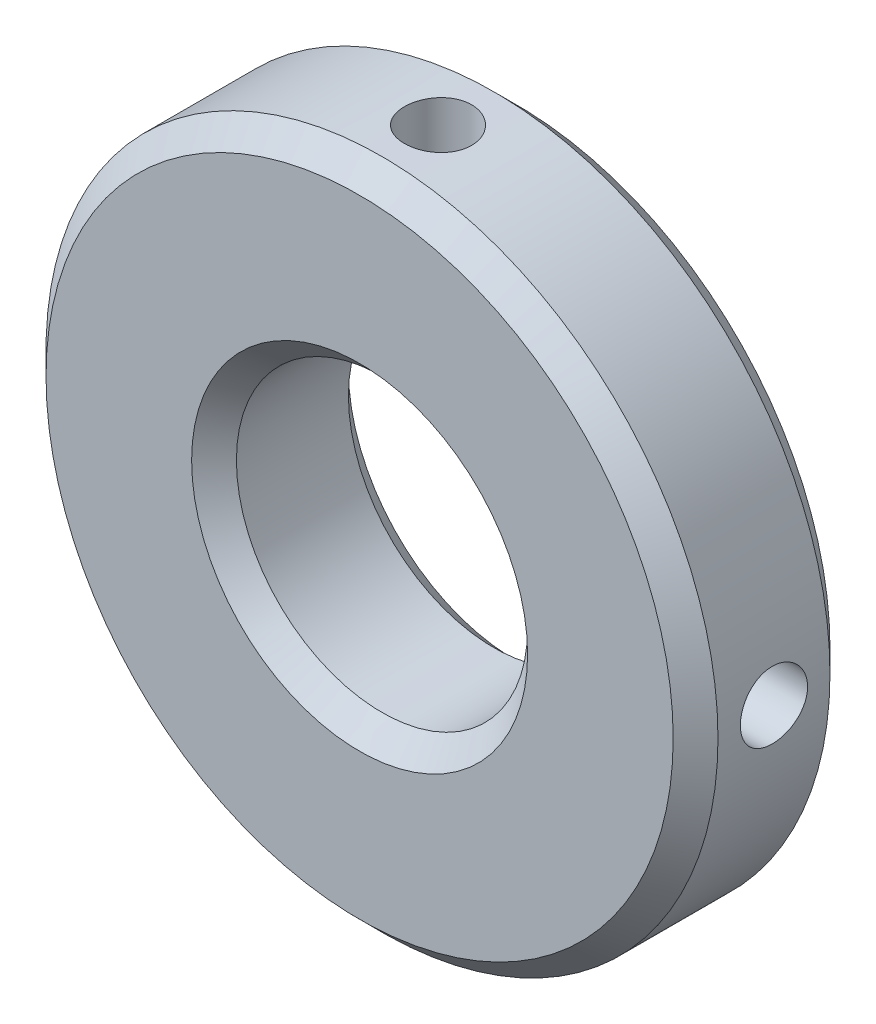
ISO-10303-21;
HEADER;
FILE_DESCRIPTION(('STEP AP214'),'2;1');
FILE_NAME('part.step','',(''),(''),'','','');
FILE_SCHEMA(('AUTOMOTIVE_DESIGN { 1 0 10303 214 1 1 1 1 }'));
ENDSEC;
DATA;
#1=APPLICATION_CONTEXT('core data for automotive mechanical design processes');
#2=APPLICATION_PROTOCOL_DEFINITION('international standard','automotive_design',2000,#1);
#3=PRODUCT_CONTEXT('',#1,'mechanical');
#4=PRODUCT('Part','Part','',(#3));
#5=PRODUCT_RELATED_PRODUCT_CATEGORY('part','',(#4));
#6=PRODUCT_DEFINITION_FORMATION('','',#4);
#7=PRODUCT_DEFINITION_CONTEXT('part definition',#1,'design');
#8=PRODUCT_DEFINITION('design','',#6,#7);
#9=PRODUCT_DEFINITION_SHAPE('','',#8);
#10=(LENGTH_UNIT() NAMED_UNIT(*) SI_UNIT(.MILLI.,.METRE.));
#11=(NAMED_UNIT(*) PLANE_ANGLE_UNIT() SI_UNIT($,.RADIAN.));
#12=(NAMED_UNIT(*) SI_UNIT($,.STERADIAN.) SOLID_ANGLE_UNIT());
#13=UNCERTAINTY_MEASURE_WITH_UNIT(LENGTH_MEASURE(1.E-05),#10,'distance_accuracy_value','');
#14=(GEOMETRIC_REPRESENTATION_CONTEXT(3) GLOBAL_UNCERTAINTY_ASSIGNED_CONTEXT((#13)) GLOBAL_UNIT_ASSIGNED_CONTEXT((#10,
#11,#12)) REPRESENTATION_CONTEXT('',''));
#15=CARTESIAN_POINT('',(0.,0.,0.));
#16=DIRECTION('',(0.,0.,1.));
#17=DIRECTION('',(1.,0.,0.));
#18=AXIS2_PLACEMENT_3D('',#15,#16,#17);
#19=CARTESIAN_POINT('',(0.,0.,-3.5));
#20=DIRECTION('',(0.,0.,1.));
#21=DIRECTION('',(1.,0.,0.));
#22=AXIS2_PLACEMENT_3D('',#19,#20,#21);
#23=CYLINDRICAL_SURFACE('',#22,15.);
#24=CARTESIAN_POINT('',(0.,0.,-2.5));
#25=DIRECTION('',(0.,0.,1.));
#26=DIRECTION('',(1.,0.,0.));
#27=AXIS2_PLACEMENT_3D('',#24,#25,#26);
#28=CIRCLE('',#27,15.);
#29=CARTESIAN_POINT('',(15.,0.,-2.5));
#30=VERTEX_POINT('',#29);
#31=EDGE_CURVE('E55',#30,#30,#28,.T.);
#32=ORIENTED_EDGE('',*,*,#31,.T.);
#33=EDGE_LOOP('',(#32));
#34=FACE_BOUND('',#33,.T.);
#35=CARTESIAN_POINT('',(0.,0.,2.5));
#36=DIRECTION('',(0.,0.,1.));
#37=DIRECTION('',(1.,0.,0.));
#38=AXIS2_PLACEMENT_3D('',#35,#36,#37);
#39=CIRCLE('',#38,15.);
#40=CARTESIAN_POINT('',(15.,0.,2.5));
#41=VERTEX_POINT('',#40);
#42=EDGE_CURVE('E58',#41,#41,#39,.F.);
#43=ORIENTED_EDGE('',*,*,#42,.T.);
#44=EDGE_LOOP('',(#43));
#45=FACE_BOUND('',#44,.T.);
#46=CARTESIAN_POINT('',(0.,15.,1.49999999999999));
#47=CARTESIAN_POINT('',(0.0840305306873352,14.9999990328115,1.49999636114942));
#48=CARTESIAN_POINT('',(0.168116617751658,14.9992863839431,1.49291509665532));
#49=CARTESIAN_POINT('',(0.333957597745253,14.9965120139211,1.46477344456435));
#50=CARTESIAN_POINT('',(0.415709818753238,14.9944488065104,1.4436976559631));
#51=CARTESIAN_POINT('',(0.574457513180117,14.9892062184461,1.38818663910324));
#52=CARTESIAN_POINT('',(0.651455826922359,14.9860275120106,1.35375947922228));
#53=CARTESIAN_POINT('',(0.798564241440603,14.9789093609146,1.27253863810252));
#54=CARTESIAN_POINT('',(0.868675708168608,14.974970067572,1.22574741599978));
#55=CARTESIAN_POINT('',(1.00028932601112,14.9667561651199,1.12094595350658));
#56=CARTESIAN_POINT('',(1.06176321725233,14.962480523608,1.06290030089694));
#57=CARTESIAN_POINT('',(1.17411378214647,14.9540843535939,0.937313198605447));
#58=CARTESIAN_POINT('',(1.22498996562397,14.9499638322738,0.869771309936413));
#59=CARTESIAN_POINT('',(1.31480095566541,14.9423338732918,0.726932202474563));
#60=CARTESIAN_POINT('',(1.35371019818231,14.9388257506636,0.651618833857707));
#61=CARTESIAN_POINT('',(1.41831957711413,14.9328305631979,0.495486621142528));
#62=CARTESIAN_POINT('',(1.44402003988692,14.9303434731333,0.414667913124072));
#63=CARTESIAN_POINT('',(1.48139856240283,14.9266812610947,0.250107298700984));
#64=CARTESIAN_POINT('',(1.49312347950568,14.9255017559714,0.166376134721686));
#65=CARTESIAN_POINT('',(1.50236292770303,14.9245746459079,-0.0018732950936708));
#66=CARTESIAN_POINT('',(1.49987783230619,14.9248270033312,-0.0863915401830883));
#67=CARTESIAN_POINT('',(1.48080642037901,14.926731103484,-0.253492964539976));
#68=CARTESIAN_POINT('',(1.46427126618682,14.9283777688598,-0.336082048993039));
#69=CARTESIAN_POINT('',(1.41764871622587,14.9328770143113,-0.497306944801638));
#70=CARTESIAN_POINT('',(1.38756113738361,14.9357296106774,-0.575942702737542));
#71=CARTESIAN_POINT('',(1.31463134082225,14.9423251417811,-0.727190380948328));
#72=CARTESIAN_POINT('',(1.27176642407996,14.9460696586224,-0.799791284233967));
#73=CARTESIAN_POINT('',(1.17451504102983,14.9540257759932,-0.936787822367816));
#74=CARTESIAN_POINT('',(1.12012823750475,14.9582373901918,-1.00118321697264));
#75=CARTESIAN_POINT('',(1.0010911686181,14.9666757796948,-1.12023809098353));
#76=CARTESIAN_POINT('',(0.936396718277038,14.970902539995,-1.1748534028212));
#77=CARTESIAN_POINT('',(0.798734222605662,14.9788774361778,-1.27245544936557));
#78=CARTESIAN_POINT('',(0.725766167999395,14.9826255715238,-1.3154421710347));
#79=CARTESIAN_POINT('',(0.573597158538542,14.9892221350064,-1.38856503046537));
#80=CARTESIAN_POINT('',(0.494395119584851,14.9920704062215,-1.41869892722708));
#81=CARTESIAN_POINT('',(0.332020825994896,14.9965447116211,-1.46522837506762));
#82=CARTESIAN_POINT('',(0.248848690164899,14.9981707823559,-1.48162433698592));
#83=CARTESIAN_POINT('',(0.0812776486378552,15.0000127750247,-1.50015646160214));
#84=CARTESIAN_POINT('',(-0.00311445315823764,15.000234724016,-1.50235357237874));
#85=CARTESIAN_POINT('',(-0.171065689973548,14.999259626352,-1.49258570542684));
#86=CARTESIAN_POINT('',(-0.254624836230703,14.998062598867,-1.48062091902707));
#87=CARTESIAN_POINT('',(-0.418362310252008,14.9943879230879,-1.44291945686762));
#88=CARTESIAN_POINT('',(-0.498547273458025,14.9919129287706,-1.41721131828297));
#89=CARTESIAN_POINT('',(-0.653466482075667,14.9859599829091,-1.35278223894408));
#90=CARTESIAN_POINT('',(-0.72820060523567,14.9824820088788,-1.31406100644089));
#91=CARTESIAN_POINT('',(-0.870372270258206,14.9748971299563,-1.22455374200412));
#92=CARTESIAN_POINT('',(-0.937784489623368,14.9707881540516,-1.17372766661127));
#93=CARTESIAN_POINT('',(-1.06314243496781,14.9624089930428,-1.0615108983886));
#94=CARTESIAN_POINT('',(-1.12108792327376,14.9581388038946,-1.00011994039452));
#95=CARTESIAN_POINT('',(-1.22607916483071,14.9499003621113,-0.868250138011492));
#96=CARTESIAN_POINT('',(-1.2730849180193,14.9459332520846,-0.797739365186062));
#97=CARTESIAN_POINT('',(-1.35458738811573,14.9387674869133,-0.649788959779968));
#98=CARTESIAN_POINT('',(-1.38908427608081,14.9355688212606,-0.572349421967402));
#99=CARTESIAN_POINT('',(-1.4445228130267,14.9303092145107,-0.412876890801306));
#100=CARTESIAN_POINT('',(-1.46548826221778,14.9282462767468,-0.330852239863317));
#101=CARTESIAN_POINT('',(-1.49334601069418,14.9254854792431,-0.164425203058841));
#102=CARTESIAN_POINT('',(-1.50023871359926,14.9247875803528,-0.0800228854564888));
#103=CARTESIAN_POINT('',(-1.49974970770687,14.9248366966134,0.0883660325350558));
#104=CARTESIAN_POINT('',(-1.49243083438966,14.9255773513051,0.172352824324221));
#105=CARTESIAN_POINT('',(-1.46385817944547,14.9284065583432,0.337897375752429));
#106=CARTESIAN_POINT('',(-1.44260438214323,14.9304951122058,0.419455132658966));
#107=CARTESIAN_POINT('',(-1.38678252944624,14.9357830239478,0.57782602357178));
#108=CARTESIAN_POINT('',(-1.35221631651136,14.9389822281054,0.654639812444582));
#109=CARTESIAN_POINT('',(-1.27075733236656,14.9461312775904,0.801385337506546));
#110=CARTESIAN_POINT('',(-1.22386463018311,14.9500811187143,0.871317112230937));
#111=CARTESIAN_POINT('',(-1.11884783442799,14.9583073081455,1.0026355117079));
#112=CARTESIAN_POINT('',(-1.06067692333539,14.9625849709013,1.06398461455062));
#113=CARTESIAN_POINT('',(-0.934847548837657,14.9709728209317,1.17607834904948));
#114=CARTESIAN_POINT('',(-0.867186816162379,14.9750829678446,1.22682043703574));
#115=CARTESIAN_POINT('',(-0.724112151241928,14.9826834310374,1.31636018078192));
#116=CARTESIAN_POINT('',(-0.64867912402014,14.9861721604022,1.35512743641776));
#117=CARTESIAN_POINT('',(-0.492387418650822,14.9921194387484,1.41939363423579));
#118=CARTESIAN_POINT('',(-0.411534974738411,14.9945791486448,1.44490753643031));
#119=CARTESIAN_POINT('',(-0.275187392108555,14.997573206606,1.47558092562719));
#120=CARTESIAN_POINT('',(-0.220563829266762,14.9984790103775,1.48472556644902));
#121=CARTESIAN_POINT('',(-0.110634871225969,14.9996927242618,1.49693628909263));
#122=CARTESIAN_POINT('',(-0.0553294788398363,15.0000006368404,1.50000239598278));
#123=CARTESIAN_POINT('',(0.,15.,1.49999999999999));
#124=B_SPLINE_CURVE_WITH_KNOTS('',3,(#46,#47,#48,#49,#50,#51,#52,#53,#54,#55,#56,#57,#58,#59,
#60,#61,#62,#63,#64,#65,#66,#67,#68,#69,#70,#71,#72,#73,#74,#75,#76,#77,#78,#79,#80,#81,#82,#83,
#84,#85,#86,#87,#88,#89,#90,#91,#92,#93,#94,#95,#96,#97,#98,#99,#100,#101,#102,#103,#104,#105,
#106,#107,#108,#109,#110,#111,#112,#113,#114,#115,#116,#117,#118,#119,#120,#121,#122,#123),
.UNSPECIFIED.,.T.,.F.,(4,2,2,2,2,2,2,2,2,2,2,2,2,2,2,2,2,2,2,2,2,2,2,2,2,2,2,2,2,2,2,2,2,2,2,2,
2,2,4),(0.,0.251889549402709,0.504056764253226,0.756071828598297,1.00803680637417,
1.26080785293441,1.51359058831058,1.76690963208331,2.02022241663754,2.27268348067793,
2.52513790883663,2.77667696161664,3.02821941242448,3.28021142059339,3.53221080496685,
3.78532101294307,4.03843150469654,4.29158611040369,4.54473314513156,4.79679282911633,
5.04884910778711,5.30038402941453,5.55192459074196,5.80430911123043,6.0566999671534,
6.30999965412892,6.56329587713056,6.81614535889499,7.06898758859372,7.32071443940929,
7.57244157339053,7.82413388044194,8.07582477808434,8.32858376141473,8.5814032895543,
8.83485946539357,9.08802892192935,9.25388500848515,9.41974041103533),.UNSPECIFIED.);
#125=CARTESIAN_POINT('',(0.,15.,1.49999999999999));
#126=VERTEX_POINT('',#125);
#127=EDGE_CURVE('E69',#126,#126,#124,.T.);
#128=ORIENTED_EDGE('',*,*,#127,.F.);
#129=EDGE_LOOP('',(#128));
#130=FACE_BOUND('',#129,.T.);
#131=CARTESIAN_POINT('',(15.,0.,-1.49999999999999));
#132=CARTESIAN_POINT('',(14.9999990328115,0.0840305306873352,-1.49999636114942));
#133=CARTESIAN_POINT('',(14.9992863839431,0.168116617751658,-1.49291509665532));
#134=CARTESIAN_POINT('',(14.9965120139211,0.333957597745253,-1.46477344456435));
#135=CARTESIAN_POINT('',(14.9944488065104,0.415709818753239,-1.4436976559631));
#136=CARTESIAN_POINT('',(14.9892062184461,0.574457513180117,-1.38818663910324));
#137=CARTESIAN_POINT('',(14.9860275120106,0.651455826922359,-1.35375947922228));
#138=CARTESIAN_POINT('',(14.9789093609146,0.798564241440604,-1.27253863810252));
#139=CARTESIAN_POINT('',(14.974970067572,0.868675708168608,-1.22574741599978));
#140=CARTESIAN_POINT('',(14.9667561651199,1.00028932601111,-1.12094595350658));
#141=CARTESIAN_POINT('',(14.962480523608,1.06176321725233,-1.06290030089694));
#142=CARTESIAN_POINT('',(14.9540843535939,1.17411378214647,-0.937313198605447));
#143=CARTESIAN_POINT('',(14.9499638322738,1.22498996562397,-0.869771309936413));
#144=CARTESIAN_POINT('',(14.9423338732918,1.31480095566541,-0.726932202474563));
#145=CARTESIAN_POINT('',(14.9388257506636,1.35371019818231,-0.651618833857707));
#146=CARTESIAN_POINT('',(14.9328305631979,1.41831957711413,-0.495486621142528));
#147=CARTESIAN_POINT('',(14.9303434731333,1.44402003988692,-0.414667913124072));
#148=CARTESIAN_POINT('',(14.9266812610947,1.48139856240283,-0.250107298700984));
#149=CARTESIAN_POINT('',(14.9255017559714,1.49312347950568,-0.166376134721686));
#150=CARTESIAN_POINT('',(14.9245746459079,1.50236292770303,0.00187329509367096));
#151=CARTESIAN_POINT('',(14.9248270033312,1.49987783230619,0.0863915401830883));
#152=CARTESIAN_POINT('',(14.926731103484,1.48080642037901,0.253492964539976));
#153=CARTESIAN_POINT('',(14.9283777688598,1.46427126618682,0.336082048993039));
#154=CARTESIAN_POINT('',(14.9328770143113,1.41764871622587,0.497306944801637));
#155=CARTESIAN_POINT('',(14.9357296106774,1.38756113738361,0.575942702737542));
#156=CARTESIAN_POINT('',(14.9423251417811,1.31463134082225,0.727190380948328));
#157=CARTESIAN_POINT('',(14.9460696586224,1.27176642407996,0.799791284233967));
#158=CARTESIAN_POINT('',(14.9540257759932,1.17451504102983,0.936787822367816));
#159=CARTESIAN_POINT('',(14.9582373901918,1.12012823750475,1.00118321697264));
#160=CARTESIAN_POINT('',(14.9666757796948,1.0010911686181,1.12023809098353));
#161=CARTESIAN_POINT('',(14.970902539995,0.936396718277038,1.1748534028212));
#162=CARTESIAN_POINT('',(14.9788774361778,0.798734222605663,1.27245544936557));
#163=CARTESIAN_POINT('',(14.9826255715238,0.725766167999396,1.3154421710347));
#164=CARTESIAN_POINT('',(14.9892221350064,0.573597158538542,1.38856503046537));
#165=CARTESIAN_POINT('',(14.9920704062215,0.494395119584851,1.41869892722708));
#166=CARTESIAN_POINT('',(14.9965447116211,0.332020825994896,1.46522837506762));
#167=CARTESIAN_POINT('',(14.9981707823559,0.248848690164899,1.48162433698592));
#168=CARTESIAN_POINT('',(15.0000127750247,0.0812776486378553,1.50015646160214));
#169=CARTESIAN_POINT('',(15.000234724016,-0.00311445315823759,1.50235357237874));
#170=CARTESIAN_POINT('',(14.999259626352,-0.171065689973548,1.49258570542684));
#171=CARTESIAN_POINT('',(14.998062598867,-0.254624836230703,1.48062091902707));
#172=CARTESIAN_POINT('',(14.9943879230879,-0.418362310252008,1.44291945686762));
#173=CARTESIAN_POINT('',(14.9919129287706,-0.498547273458024,1.41721131828297));
#174=CARTESIAN_POINT('',(14.9859599829091,-0.653466482075667,1.35278223894408));
#175=CARTESIAN_POINT('',(14.9824820088788,-0.72820060523567,1.31406100644089));
#176=CARTESIAN_POINT('',(14.9748971299563,-0.870372270258207,1.22455374200412));
#177=CARTESIAN_POINT('',(14.9707881540516,-0.937784489623368,1.17372766661126));
#178=CARTESIAN_POINT('',(14.9624089930428,-1.06314243496781,1.0615108983886));
#179=CARTESIAN_POINT('',(14.9581388038946,-1.12108792327376,1.00011994039452));
#180=CARTESIAN_POINT('',(14.9499003621113,-1.22607916483071,0.868250138011492));
#181=CARTESIAN_POINT('',(14.9459332520846,-1.2730849180193,0.797739365186062));
#182=CARTESIAN_POINT('',(14.9387674869133,-1.35458738811573,0.649788959779968));
#183=CARTESIAN_POINT('',(14.9355688212606,-1.38908427608081,0.572349421967402));
#184=CARTESIAN_POINT('',(14.9303092145107,-1.4445228130267,0.412876890801306));
#185=CARTESIAN_POINT('',(14.9282462767468,-1.46548826221778,0.330852239863317));
#186=CARTESIAN_POINT('',(14.9254854792431,-1.49334601069418,0.164425203058841));
#187=CARTESIAN_POINT('',(14.9247875803528,-1.50023871359926,0.0800228854564886));
#188=CARTESIAN_POINT('',(14.9248366966134,-1.49974970770687,-0.0883660325350558));
#189=CARTESIAN_POINT('',(14.9255773513051,-1.49243083438966,-0.172352824324221));
#190=CARTESIAN_POINT('',(14.9284065583432,-1.46385817944547,-0.337897375752429));
#191=CARTESIAN_POINT('',(14.9304951122058,-1.44260438214323,-0.419455132658966));
#192=CARTESIAN_POINT('',(14.9357830239478,-1.38678252944624,-0.57782602357178));
#193=CARTESIAN_POINT('',(14.9389822281054,-1.35221631651136,-0.654639812444582));
#194=CARTESIAN_POINT('',(14.9461312775904,-1.27075733236656,-0.801385337506546));
#195=CARTESIAN_POINT('',(14.9500811187143,-1.22386463018311,-0.871317112230937));
#196=CARTESIAN_POINT('',(14.9583073081455,-1.11884783442799,-1.0026355117079));
#197=CARTESIAN_POINT('',(14.9625849709013,-1.06067692333539,-1.06398461455062));
#198=CARTESIAN_POINT('',(14.9709728209317,-0.934847548837657,-1.17607834904948));
#199=CARTESIAN_POINT('',(14.9750829678446,-0.867186816162379,-1.22682043703574));
#200=CARTESIAN_POINT('',(14.9826834310374,-0.724112151241928,-1.31636018078192));
#201=CARTESIAN_POINT('',(14.9861721604022,-0.64867912402014,-1.35512743641776));
#202=CARTESIAN_POINT('',(14.9921194387484,-0.492387418650822,-1.41939363423579));
#203=CARTESIAN_POINT('',(14.9945791486448,-0.411534974738411,-1.44490753643031));
#204=CARTESIAN_POINT('',(14.997573206606,-0.275187392108555,-1.47558092562719));
#205=CARTESIAN_POINT('',(14.9984790103775,-0.220563829266762,-1.48472556644902));
#206=CARTESIAN_POINT('',(14.9996927242618,-0.110634871225969,-1.49693628909263));
#207=CARTESIAN_POINT('',(15.0000006368404,-0.0553294788398363,-1.50000239598278));
#208=CARTESIAN_POINT('',(15.,0.,-1.49999999999999));
#209=B_SPLINE_CURVE_WITH_KNOTS('',3,(#131,#132,#133,#134,#135,#136,#137,#138,#139,#140,#141,
#142,#143,#144,#145,#146,#147,#148,#149,#150,#151,#152,#153,#154,#155,#156,#157,#158,#159,#160,
#161,#162,#163,#164,#165,#166,#167,#168,#169,#170,#171,#172,#173,#174,#175,#176,#177,#178,#179,
#180,#181,#182,#183,#184,#185,#186,#187,#188,#189,#190,#191,#192,#193,#194,#195,#196,#197,#198,
#199,#200,#201,#202,#203,#204,#205,#206,#207,#208),.UNSPECIFIED.,.T.,.F.,(4,2,2,2,2,2,2,2,2,2,2,
2,2,2,2,2,2,2,2,2,2,2,2,2,2,2,2,2,2,2,2,2,2,2,2,2,2,2,4),(0.,0.251889549402709,
0.504056764253226,0.756071828598297,1.00803680637417,1.26080785293441,1.51359058831058,
1.76690963208331,2.02022241663754,2.27268348067793,2.52513790883663,2.77667696161663,
3.02821941242448,3.28021142059339,3.53221080496685,3.78532101294307,4.03843150469654,
4.29158611040369,4.54473314513156,4.79679282911633,5.04884910778711,5.30038402941453,
5.55192459074196,5.80430911123043,6.0566999671534,6.30999965412893,6.56329587713056,
6.81614535889499,7.06898758859372,7.32071443940929,7.57244157339053,7.82413388044194,
8.07582477808434,8.32858376141473,8.5814032895543,8.83485946539357,9.08802892192935,
9.25388500848515,9.41974041103533),.UNSPECIFIED.);
#210=CARTESIAN_POINT('',(15.,0.,-1.49999999999999));
#211=VERTEX_POINT('',#210);
#212=EDGE_CURVE('E61',#211,#211,#209,.T.);
#213=ORIENTED_EDGE('',*,*,#212,.F.);
#214=EDGE_LOOP('',(#213));
#215=FACE_BOUND('',#214,.T.);
#216=ADVANCED_FACE('F29',(#34,#45,#130,#215),#23,.T.);
#217=CARTESIAN_POINT('',(0.,0.,-3.5));
#218=DIRECTION('',(0.,0.,1.));
#219=DIRECTION('',(1.,0.,0.));
#220=AXIS2_PLACEMENT_3D('',#217,#218,#219);
#221=PLANE('',#220);
#222=CARTESIAN_POINT('',(0.,0.,-3.5));
#223=DIRECTION('',(0.,0.,1.));
#224=DIRECTION('',(1.,0.,0.));
#225=AXIS2_PLACEMENT_3D('',#222,#223,#224);
#226=CIRCLE('',#225,14.);
#227=CARTESIAN_POINT('',(14.,0.,-3.5));
#228=VERTEX_POINT('',#227);
#229=EDGE_CURVE('E49',#228,#228,#226,.F.);
#230=ORIENTED_EDGE('',*,*,#229,.T.);
#231=EDGE_LOOP('',(#230));
#232=FACE_BOUND('',#231,.T.);
#233=CARTESIAN_POINT('',(0.,0.,-3.5));
#234=DIRECTION('',(0.,0.,1.));
#235=DIRECTION('',(1.,0.,0.));
#236=AXIS2_PLACEMENT_3D('',#233,#234,#235);
#237=CIRCLE('',#236,7.5);
#238=CARTESIAN_POINT('',(7.5,0.,-3.5));
#239=VERTEX_POINT('',#238);
#240=EDGE_CURVE('E52',#239,#239,#237,.T.);
#241=ORIENTED_EDGE('',*,*,#240,.T.);
#242=EDGE_LOOP('',(#241));
#243=FACE_BOUND('',#242,.T.);
#244=ADVANCED_FACE('F97',(#232,#243),#221,.F.);
#245=CARTESIAN_POINT('',(0.,0.,-3.5));
#246=DIRECTION('',(0.,0.,1.));
#247=DIRECTION('',(1.,0.,0.));
#248=AXIS2_PLACEMENT_3D('',#245,#246,#247);
#249=CYLINDRICAL_SURFACE('',#248,6.5);
#250=CARTESIAN_POINT('',(0.,0.,-2.5));
#251=DIRECTION('',(0.,0.,1.));
#252=DIRECTION('',(1.,0.,0.));
#253=AXIS2_PLACEMENT_3D('',#250,#251,#252);
#254=CIRCLE('',#253,6.5);
#255=CARTESIAN_POINT('',(6.5,0.,-2.5));
#256=VERTEX_POINT('',#255);
#257=EDGE_CURVE('E40',#256,#256,#254,.F.);
#258=ORIENTED_EDGE('',*,*,#257,.T.);
#259=EDGE_LOOP('',(#258));
#260=FACE_BOUND('',#259,.T.);
#261=CARTESIAN_POINT('',(0.,0.,2.5));
#262=DIRECTION('',(0.,0.,1.));
#263=DIRECTION('',(1.,0.,0.));
#264=AXIS2_PLACEMENT_3D('',#261,#262,#263);
#265=CIRCLE('',#264,6.5);
#266=CARTESIAN_POINT('',(6.5,0.,2.5));
#267=VERTEX_POINT('',#266);
#268=EDGE_CURVE('E44',#267,#267,#265,.T.);
#269=ORIENTED_EDGE('',*,*,#268,.T.);
#270=EDGE_LOOP('',(#269));
#271=FACE_BOUND('',#270,.T.);
#272=CARTESIAN_POINT('',(0.,6.5,1.49999999999999));
#273=CARTESIAN_POINT('',(0.0830761724763337,6.49999849532867,1.4999973346441));
#274=CARTESIAN_POINT('',(0.166183602986825,6.49839124214546,1.4930750731889));
#275=CARTESIAN_POINT('',(0.330029933246624,6.49213500375529,1.46560235711434));
#276=CARTESIAN_POINT('',(0.410767233683359,6.48748401185166,1.44504291155859));
#277=CARTESIAN_POINT('',(0.567482400649434,6.47565710646771,1.39098030105906));
#278=CARTESIAN_POINT('',(0.643465410431952,6.46848397910972,1.35749141486864));
#279=CARTESIAN_POINT('',(0.788732955280495,6.45238316831829,1.27856773493163));
#280=CARTESIAN_POINT('',(0.858017512835933,6.44345549077589,1.23313298129405));
#281=CARTESIAN_POINT('',(0.989152353123201,6.42464323305021,1.13075474832275));
#282=CARTESIAN_POINT('',(1.0508667921612,6.41474568654138,1.07363963829748));
#283=CARTESIAN_POINT('',(1.16393060397694,6.39519859507266,0.949890073428663));
#284=CARTESIAN_POINT('',(1.21527896649909,6.38554907436474,0.883254691839524));
#285=CARTESIAN_POINT('',(1.30676695752559,6.36746174180576,0.741333072439657));
#286=CARTESIAN_POINT('',(1.34675925477787,6.35904049089482,0.66594955902317));
#287=CARTESIAN_POINT('',(1.41345395330061,6.34455046029963,0.50930490134943));
#288=CARTESIAN_POINT('',(1.44015813854147,6.33848136485541,0.428044547754893));
#289=CARTESIAN_POINT('',(1.47906424258559,6.32951534623235,0.263434198417308));
#290=CARTESIAN_POINT('',(1.49150809496878,6.32656557105072,0.180144326625198));
#291=CARTESIAN_POINT('',(1.50229307046532,6.32401364937952,0.0126109129543638));
#292=CARTESIAN_POINT('',(1.50063613156307,6.32441104286173,-0.0716324962827486));
#293=CARTESIAN_POINT('',(1.48346063285702,6.32846083321139,-0.236862807823798));
#294=CARTESIAN_POINT('',(1.46822575315177,6.33204661249556,-0.317881081343939));
#295=CARTESIAN_POINT('',(1.42477741479347,6.34196351386388,-0.476179791901619));
#296=CARTESIAN_POINT('',(1.3965631546267,6.34829480548987,-0.553459997777077));
#297=CARTESIAN_POINT('',(1.32770349075045,6.36305332227188,-0.702872671640928));
#298=CARTESIAN_POINT('',(1.28695129246527,6.37149843240945,-0.774954080910969));
#299=CARTESIAN_POINT('',(1.19424748975255,6.38952239681953,-0.91135923628937));
#300=CARTESIAN_POINT('',(1.1422941964553,6.39910142196225,-0.975681810259014));
#301=CARTESIAN_POINT('',(1.02717321086452,6.41859777640792,-1.09637395005096));
#302=CARTESIAN_POINT('',(0.963764950845045,6.42851768847713,-1.15251388512496));
#303=CARTESIAN_POINT('',(0.828318641053398,6.447368160694,-1.25340307097535));
#304=CARTESIAN_POINT('',(0.756280398745023,6.45629869876004,-1.29815206754857));
#305=CARTESIAN_POINT('',(0.605321277972366,6.47219854082993,-1.37505591414331));
#306=CARTESIAN_POINT('',(0.526383143294244,6.47916273202417,-1.40717801569266));
#307=CARTESIAN_POINT('',(0.364032396252579,6.49030757986402,-1.45763614369504));
#308=CARTESIAN_POINT('',(0.280620512374235,6.49448868821629,-1.47597440738846));
#309=CARTESIAN_POINT('',(0.113657323931639,6.49953102945198,-1.49800415034813));
#310=CARTESIAN_POINT('',(0.0301494450127283,6.50046326526885,-1.50200893605972));
#311=CARTESIAN_POINT('',(-0.136342371579223,6.49910299913129,-1.49611098524071));
#312=CARTESIAN_POINT('',(-0.219326348562744,6.49681074208306,-1.48620930493199));
#313=CARTESIAN_POINT('',(-0.381357903798021,6.48930412349636,-1.45303880339422));
#314=CARTESIAN_POINT('',(-0.460441464875697,6.48412623941868,-1.42993675868285));
#315=CARTESIAN_POINT('',(-0.61360962248166,6.47142910428788,-1.37120841107562));
#316=CARTESIAN_POINT('',(-0.687693760726582,6.4639096389422,-1.33558096186414));
#317=CARTESIAN_POINT('',(-0.830037615110181,6.44718996088191,-1.25217735607901));
#318=CARTESIAN_POINT('',(-0.898188410296319,6.43796535296184,-1.20422030811479));
#319=CARTESIAN_POINT('',(-1.02558718048178,6.41890391913982,-1.09775438264143));
#320=CARTESIAN_POINT('',(-1.08483385664762,6.40906700421673,-1.03924396845843));
#321=CARTESIAN_POINT('',(-1.19400102833016,6.38964047483402,-0.911887614120964));
#322=CARTESIAN_POINT('',(-1.24370343589041,6.3800601750374,-0.84285303532259));
#323=CARTESIAN_POINT('',(-1.33081235446408,6.36246188496285,-0.697234119784715));
#324=CARTESIAN_POINT('',(-1.36821941224619,6.35444382521927,-0.620650118961546));
#325=CARTESIAN_POINT('',(-1.42941066868128,6.34095951164846,-0.462524011577474));
#326=CARTESIAN_POINT('',(-1.45327404481081,6.33547846174879,-0.38101387031656));
#327=CARTESIAN_POINT('',(-1.48692530676325,6.3276660054956,-0.214996007152232));
#328=CARTESIAN_POINT('',(-1.49671574099562,6.32533402889437,-0.130488830809975));
#329=CARTESIAN_POINT('',(-1.50182536015785,6.32412253425542,0.0369182270526229));
#330=CARTESIAN_POINT('',(-1.4974912787147,6.32516029248236,0.119807110648558));
#331=CARTESIAN_POINT('',(-1.4752568598088,6.33038270361014,0.28363867866818));
#332=CARTESIAN_POINT('',(-1.45735672124417,6.33456731037362,0.36458139160761));
#333=CARTESIAN_POINT('',(-1.40867420720142,6.34556939165105,0.521909910791122));
#334=CARTESIAN_POINT('',(-1.37794771033571,6.35237543592818,0.598313860705851));
#335=CARTESIAN_POINT('',(-1.30453082227099,6.36785683112449,0.744931806541325));
#336=CARTESIAN_POINT('',(-1.26183902581513,6.37653240158127,0.815145074127347));
#337=CARTESIAN_POINT('',(-1.16457679516262,6.39501829374307,0.949085528590072));
#338=CARTESIAN_POINT('',(-1.10976162033286,6.4048496868242,1.01263211954957));
#339=CARTESIAN_POINT('',(-0.990297714593203,6.42440402438128,1.12973824763829));
#340=CARTESIAN_POINT('',(-0.925646696024372,6.43412694306169,1.18329545493027));
#341=CARTESIAN_POINT('',(-0.787191932761547,6.45253999299533,1.2796672679488));
#342=CARTESIAN_POINT('',(-0.71326686908488,6.46121270567525,1.32231111828977));
#343=CARTESIAN_POINT('',(-0.559109641475363,6.47637045552876,1.3944991494086));
#344=CARTESIAN_POINT('',(-0.47888254710193,6.48285722936411,1.42405373510292));
#345=CARTESIAN_POINT('',(-0.332210374198764,6.49182723396726,1.46427847355572));
#346=CARTESIAN_POINT('',(-0.266526367321006,6.49487228966801,1.47764727102699));
#347=CARTESIAN_POINT('',(-0.133901630280834,6.4989592245111,1.49550886661471));
#348=CARTESIAN_POINT('',(-0.06696096878983,6.5000012127936,1.50000214832733));
#349=CARTESIAN_POINT('',(0.,6.5,1.49999999999999));
#350=B_SPLINE_CURVE_WITH_KNOTS('',3,(#272,#273,#274,#275,#276,#277,#278,#279,#280,#281,#282,
#283,#284,#285,#286,#287,#288,#289,#290,#291,#292,#293,#294,#295,#296,#297,#298,#299,#300,#301,
#302,#303,#304,#305,#306,#307,#308,#309,#310,#311,#312,#313,#314,#315,#316,#317,#318,#319,#320,
#321,#322,#323,#324,#325,#326,#327,#328,#329,#330,#331,#332,#333,#334,#335,#336,#337,#338,#339,
#340,#341,#342,#343,#344,#345,#346,#347,#348,#349),.UNSPECIFIED.,.T.,.F.,(4,2,2,2,2,2,2,2,2,2,2,
2,2,2,2,2,2,2,2,2,2,2,2,2,2,2,2,2,2,2,2,2,2,2,2,2,2,2,4),(0.,0.248983311217112,
0.498130939431094,0.747004202472741,0.995876629917194,1.24870930222221,1.50156660317463,
1.75756840109409,2.01353582069619,2.26509316141454,2.516615929156,2.76300377758326,
3.00940684320481,3.25796969712263,3.50657005489339,3.76117526279508,4.01578615203539,
4.27105309772999,4.52627860236002,4.77589001432912,5.02548246887367,5.27198911757473,
5.51851833225477,5.76889433751047,6.01930682944863,6.27489540554872,6.53047261420156,
6.78453988631535,7.03856114466411,7.2863940143866,7.53422325058911,7.78098389306524,
8.02777352833795,8.280093237097,8.53247172132996,8.7885860972729,9.04449651578214,
9.24519271684369,9.44587798236127),.UNSPECIFIED.);
#351=CARTESIAN_POINT('',(0.,6.5,1.49999999999999));
#352=VERTEX_POINT('',#351);
#353=EDGE_CURVE('E62',#352,#352,#350,.T.);
#354=ORIENTED_EDGE('',*,*,#353,.T.);
#355=EDGE_LOOP('',(#354));
#356=FACE_BOUND('',#355,.T.);
#357=CARTESIAN_POINT('',(6.5,0.,-1.49999999999999));
#358=CARTESIAN_POINT('',(6.49999849532867,0.0830761724763337,-1.4999973346441));
#359=CARTESIAN_POINT('',(6.49839124214546,0.166183602986825,-1.4930750731889));
#360=CARTESIAN_POINT('',(6.49213500375529,0.330029933246624,-1.46560235711434));
#361=CARTESIAN_POINT('',(6.48748401185166,0.410767233683359,-1.44504291155859));
#362=CARTESIAN_POINT('',(6.47565710646771,0.567482400649434,-1.39098030105906));
#363=CARTESIAN_POINT('',(6.46848397910972,0.643465410431952,-1.35749141486864));
#364=CARTESIAN_POINT('',(6.45238316831829,0.788732955280495,-1.27856773493163));
#365=CARTESIAN_POINT('',(6.44345549077589,0.858017512835933,-1.23313298129405));
#366=CARTESIAN_POINT('',(6.42464323305021,0.989152353123201,-1.13075474832275));
#367=CARTESIAN_POINT('',(6.41474568654138,1.0508667921612,-1.07363963829748));
#368=CARTESIAN_POINT('',(6.39519859507266,1.16393060397694,-0.949890073428663));
#369=CARTESIAN_POINT('',(6.38554907436474,1.21527896649909,-0.883254691839524));
#370=CARTESIAN_POINT('',(6.36746174180576,1.30676695752559,-0.741333072439657));
#371=CARTESIAN_POINT('',(6.35904049089482,1.34675925477787,-0.66594955902317));
#372=CARTESIAN_POINT('',(6.34455046029963,1.41345395330061,-0.50930490134943));
#373=CARTESIAN_POINT('',(6.33848136485541,1.44015813854147,-0.428044547754893));
#374=CARTESIAN_POINT('',(6.32951534623235,1.47906424258559,-0.263434198417308));
#375=CARTESIAN_POINT('',(6.32656557105072,1.49150809496878,-0.180144326625198));
#376=CARTESIAN_POINT('',(6.32401364937952,1.50229307046532,-0.0126109129543638));
#377=CARTESIAN_POINT('',(6.32441104286173,1.50063613156307,0.0716324962827486));
#378=CARTESIAN_POINT('',(6.32846083321139,1.48346063285702,0.236862807823798));
#379=CARTESIAN_POINT('',(6.33204661249556,1.46822575315177,0.317881081343939));
#380=CARTESIAN_POINT('',(6.34196351386388,1.42477741479347,0.476179791901619));
#381=CARTESIAN_POINT('',(6.34829480548987,1.3965631546267,0.553459997777077));
#382=CARTESIAN_POINT('',(6.36305332227188,1.32770349075045,0.702872671640928));
#383=CARTESIAN_POINT('',(6.37149843240945,1.28695129246527,0.774954080910969));
#384=CARTESIAN_POINT('',(6.38952239681953,1.19424748975255,0.91135923628937));
#385=CARTESIAN_POINT('',(6.39910142196225,1.1422941964553,0.975681810259014));
#386=CARTESIAN_POINT('',(6.41859777640792,1.02717321086452,1.09637395005096));
#387=CARTESIAN_POINT('',(6.42851768847713,0.963764950845045,1.15251388512495));
#388=CARTESIAN_POINT('',(6.447368160694,0.828318641053398,1.25340307097535));
#389=CARTESIAN_POINT('',(6.45629869876004,0.756280398745023,1.29815206754857));
#390=CARTESIAN_POINT('',(6.47219854082993,0.605321277972366,1.37505591414331));
#391=CARTESIAN_POINT('',(6.47916273202417,0.526383143294244,1.40717801569266));
#392=CARTESIAN_POINT('',(6.49030757986402,0.364032396252579,1.45763614369504));
#393=CARTESIAN_POINT('',(6.49448868821629,0.280620512374235,1.47597440738846));
#394=CARTESIAN_POINT('',(6.49953102945198,0.113657323931639,1.49800415034813));
#395=CARTESIAN_POINT('',(6.50046326526885,0.0301494450127283,1.50200893605972));
#396=CARTESIAN_POINT('',(6.49910299913129,-0.136342371579224,1.49611098524071));
#397=CARTESIAN_POINT('',(6.49681074208306,-0.219326348562744,1.48620930493199));
#398=CARTESIAN_POINT('',(6.48930412349636,-0.381357903798021,1.45303880339422));
#399=CARTESIAN_POINT('',(6.48412623941868,-0.460441464875697,1.42993675868285));
#400=CARTESIAN_POINT('',(6.47142910428788,-0.61360962248166,1.37120841107562));
#401=CARTESIAN_POINT('',(6.4639096389422,-0.687693760726582,1.33558096186414));
#402=CARTESIAN_POINT('',(6.44718996088191,-0.830037615110181,1.25217735607901));
#403=CARTESIAN_POINT('',(6.43796535296184,-0.898188410296319,1.20422030811479));
#404=CARTESIAN_POINT('',(6.41890391913982,-1.02558718048178,1.09775438264143));
#405=CARTESIAN_POINT('',(6.40906700421673,-1.08483385664762,1.03924396845843));
#406=CARTESIAN_POINT('',(6.38964047483402,-1.19400102833016,0.911887614120965));
#407=CARTESIAN_POINT('',(6.3800601750374,-1.24370343589041,0.84285303532259));
#408=CARTESIAN_POINT('',(6.36246188496285,-1.33081235446408,0.697234119784714));
#409=CARTESIAN_POINT('',(6.35444382521927,-1.36821941224619,0.620650118961546));
#410=CARTESIAN_POINT('',(6.34095951164846,-1.42941066868128,0.462524011577474));
#411=CARTESIAN_POINT('',(6.33547846174879,-1.45327404481081,0.38101387031656));
#412=CARTESIAN_POINT('',(6.3276660054956,-1.48692530676325,0.214996007152232));
#413=CARTESIAN_POINT('',(6.32533402889437,-1.49671574099562,0.130488830809975));
#414=CARTESIAN_POINT('',(6.32412253425542,-1.50182536015785,-0.0369182270526228));
#415=CARTESIAN_POINT('',(6.32516029248236,-1.4974912787147,-0.119807110648557));
#416=CARTESIAN_POINT('',(6.33038270361014,-1.4752568598088,-0.28363867866818));
#417=CARTESIAN_POINT('',(6.33456731037362,-1.45735672124417,-0.36458139160761));
#418=CARTESIAN_POINT('',(6.34556939165105,-1.40867420720142,-0.521909910791122));
#419=CARTESIAN_POINT('',(6.35237543592818,-1.37794771033571,-0.59831386070585));
#420=CARTESIAN_POINT('',(6.36785683112449,-1.30453082227099,-0.744931806541325));
#421=CARTESIAN_POINT('',(6.37653240158127,-1.26183902581513,-0.815145074127347));
#422=CARTESIAN_POINT('',(6.39501829374307,-1.16457679516262,-0.949085528590072));
#423=CARTESIAN_POINT('',(6.4048496868242,-1.10976162033286,-1.01263211954957));
#424=CARTESIAN_POINT('',(6.42440402438128,-0.990297714593203,-1.12973824763829));
#425=CARTESIAN_POINT('',(6.43412694306169,-0.925646696024372,-1.18329545493027));
#426=CARTESIAN_POINT('',(6.45253999299533,-0.787191932761547,-1.2796672679488));
#427=CARTESIAN_POINT('',(6.46121270567525,-0.713266869084881,-1.32231111828977));
#428=CARTESIAN_POINT('',(6.47637045552876,-0.559109641475364,-1.3944991494086));
#429=CARTESIAN_POINT('',(6.48285722936411,-0.47888254710193,-1.42405373510292));
#430=CARTESIAN_POINT('',(6.49182723396726,-0.332210374198765,-1.46427847355572));
#431=CARTESIAN_POINT('',(6.49487228966801,-0.266526367321006,-1.47764727102699));
#432=CARTESIAN_POINT('',(6.4989592245111,-0.133901630280835,-1.49550886661471));
#433=CARTESIAN_POINT('',(6.5000012127936,-0.0669609687898304,-1.50000214832733));
#434=CARTESIAN_POINT('',(6.5,0.,-1.49999999999999));
#435=B_SPLINE_CURVE_WITH_KNOTS('',3,(#357,#358,#359,#360,#361,#362,#363,#364,#365,#366,#367,
#368,#369,#370,#371,#372,#373,#374,#375,#376,#377,#378,#379,#380,#381,#382,#383,#384,#385,#386,
#387,#388,#389,#390,#391,#392,#393,#394,#395,#396,#397,#398,#399,#400,#401,#402,#403,#404,#405,
#406,#407,#408,#409,#410,#411,#412,#413,#414,#415,#416,#417,#418,#419,#420,#421,#422,#423,#424,
#425,#426,#427,#428,#429,#430,#431,#432,#433,#434),.UNSPECIFIED.,.T.,.F.,(4,2,2,2,2,2,2,2,2,2,2,
2,2,2,2,2,2,2,2,2,2,2,2,2,2,2,2,2,2,2,2,2,2,2,2,2,2,2,4),(0.,0.248983311217112,
0.498130939431094,0.747004202472741,0.995876629917194,1.24870930222221,1.50156660317463,
1.75756840109409,2.01353582069619,2.26509316141454,2.516615929156,2.76300377758326,
3.00940684320481,3.25796969712263,3.50657005489339,3.76117526279507,4.01578615203539,
4.27105309772999,4.52627860236002,4.77589001432912,5.02548246887367,5.27198911757473,
5.51851833225477,5.76889433751047,6.01930682944862,6.27489540554872,6.53047261420156,
6.78453988631535,7.03856114466411,7.2863940143866,7.53422325058911,7.78098389306524,
8.02777352833795,8.280093237097,8.53247172132995,8.78858609727289,9.04449651578214,
9.24519271684368,9.44587798236127),.UNSPECIFIED.);
#436=CARTESIAN_POINT('',(6.5,0.,-1.49999999999999));
#437=VERTEX_POINT('',#436);
#438=EDGE_CURVE('E91',#437,#437,#435,.T.);
#439=ORIENTED_EDGE('',*,*,#438,.T.);
#440=EDGE_LOOP('',(#439));
#441=FACE_BOUND('',#440,.T.);
#442=ADVANCED_FACE('F75',(#260,#271,#356,#441),#249,.F.);
#443=CARTESIAN_POINT('',(0.,0.,3.5));
#444=DIRECTION('',(0.,0.,1.));
#445=DIRECTION('',(1.,0.,0.));
#446=AXIS2_PLACEMENT_3D('',#443,#444,#445);
#447=PLANE('',#446);
#448=CARTESIAN_POINT('',(0.,0.,3.5));
#449=DIRECTION('',(0.,0.,1.));
#450=DIRECTION('',(1.,0.,0.));
#451=AXIS2_PLACEMENT_3D('',#448,#449,#450);
#452=CIRCLE('',#451,7.5);
#453=CARTESIAN_POINT('',(7.5,0.,3.5));
#454=VERTEX_POINT('',#453);
#455=EDGE_CURVE('E10',#454,#454,#452,.F.);
#456=ORIENTED_EDGE('',*,*,#455,.T.);
#457=EDGE_LOOP('',(#456));
#458=FACE_BOUND('',#457,.T.);
#459=CARTESIAN_POINT('',(0.,0.,3.5));
#460=DIRECTION('',(0.,0.,1.));
#461=DIRECTION('',(1.,0.,0.));
#462=AXIS2_PLACEMENT_3D('',#459,#460,#461);
#463=CIRCLE('',#462,14.);
#464=CARTESIAN_POINT('',(14.,0.,3.5));
#465=VERTEX_POINT('',#464);
#466=EDGE_CURVE('E36',#465,#465,#463,.T.);
#467=ORIENTED_EDGE('',*,*,#466,.T.);
#468=EDGE_LOOP('',(#467));
#469=FACE_BOUND('',#468,.T.);
#470=ADVANCED_FACE('F118',(#458,#469),#447,.T.);
#471=CARTESIAN_POINT('',(15.,0.,0.));
#472=DIRECTION('',(1.,0.,0.));
#473=DIRECTION('',(0.,0.,-1.));
#474=AXIS2_PLACEMENT_3D('',#471,#472,#473);
#475=CYLINDRICAL_SURFACE('',#474,1.49999999999999);
#476=ORIENTED_EDGE('',*,*,#212,.T.);
#477=EDGE_LOOP('',(#476));
#478=FACE_BOUND('',#477,.T.);
#479=ORIENTED_EDGE('',*,*,#438,.F.);
#480=EDGE_LOOP('',(#479));
#481=FACE_BOUND('',#480,.T.);
#482=ADVANCED_FACE('F83',(#478,#481),#475,.F.);
#483=CARTESIAN_POINT('',(0.,15.,0.));
#484=DIRECTION('',(0.,1.,0.));
#485=DIRECTION('',(0.,0.,1.));
#486=AXIS2_PLACEMENT_3D('',#483,#484,#485);
#487=CYLINDRICAL_SURFACE('',#486,1.49999999999999);
#488=ORIENTED_EDGE('',*,*,#127,.T.);
#489=EDGE_LOOP('',(#488));
#490=FACE_BOUND('',#489,.T.);
#491=ORIENTED_EDGE('',*,*,#353,.F.);
#492=EDGE_LOOP('',(#491));
#493=FACE_BOUND('',#492,.T.);
#494=ADVANCED_FACE('F79',(#490,#493),#487,.F.);
#495=CARTESIAN_POINT('',(0.,0.,-2.5));
#496=DIRECTION('',(0.,0.,1.));
#497=DIRECTION('',(1.,0.,0.));
#498=AXIS2_PLACEMENT_3D('',#495,#496,#497);
#499=CONICAL_SURFACE('',#498,15.,0.785398163397448);
#500=ORIENTED_EDGE('',*,*,#229,.F.);
#501=EDGE_LOOP('',(#500));
#502=FACE_BOUND('',#501,.T.);
#503=ORIENTED_EDGE('',*,*,#31,.F.);
#504=EDGE_LOOP('',(#503));
#505=FACE_BOUND('',#504,.T.);
#506=ADVANCED_FACE('F82',(#502,#505),#499,.T.);
#507=CARTESIAN_POINT('',(0.,0.,-3.5));
#508=DIRECTION('',(0.,0.,-1.));
#509=DIRECTION('',(-1.,0.,0.));
#510=AXIS2_PLACEMENT_3D('',#507,#508,#509);
#511=CONICAL_SURFACE('',#510,7.5,0.785398163397445);
#512=ORIENTED_EDGE('',*,*,#257,.F.);
#513=EDGE_LOOP('',(#512));
#514=FACE_BOUND('',#513,.T.);
#515=ORIENTED_EDGE('',*,*,#240,.F.);
#516=EDGE_LOOP('',(#515));
#517=FACE_BOUND('',#516,.T.);
#518=ADVANCED_FACE('F102',(#514,#517),#511,.F.);
#519=CARTESIAN_POINT('',(0.,0.,2.5));
#520=DIRECTION('',(0.,0.,1.));
#521=DIRECTION('',(1.,0.,0.));
#522=AXIS2_PLACEMENT_3D('',#519,#520,#521);
#523=CONICAL_SURFACE('',#522,6.5,0.78539816339745);
#524=ORIENTED_EDGE('',*,*,#455,.F.);
#525=EDGE_LOOP('',(#524));
#526=FACE_BOUND('',#525,.T.);
#527=ORIENTED_EDGE('',*,*,#268,.F.);
#528=EDGE_LOOP('',(#527));
#529=FACE_BOUND('',#528,.T.);
#530=ADVANCED_FACE('F105',(#526,#529),#523,.F.);
#531=CARTESIAN_POINT('',(0.,0.,3.5));
#532=DIRECTION('',(0.,0.,-1.));
#533=DIRECTION('',(-1.,0.,0.));
#534=AXIS2_PLACEMENT_3D('',#531,#532,#533);
#535=CONICAL_SURFACE('',#534,14.,0.785398163397448);
#536=ORIENTED_EDGE('',*,*,#42,.F.);
#537=EDGE_LOOP('',(#536));
#538=FACE_BOUND('',#537,.T.);
#539=ORIENTED_EDGE('',*,*,#466,.F.);
#540=EDGE_LOOP('',(#539));
#541=FACE_BOUND('',#540,.T.);
#542=ADVANCED_FACE('F31',(#538,#541),#535,.T.);
#543=CLOSED_SHELL('',(#216,#244,#442,#470,#482,#494,#506,#518,#530,#542));
#544=MANIFOLD_SOLID_BREP('B2',#543);
#545=ADVANCED_BREP_SHAPE_REPRESENTATION('',(#18,#544),#14);
#546=SHAPE_DEFINITION_REPRESENTATION(#9,#545);
ENDSEC;
END-ISO-10303-21;
